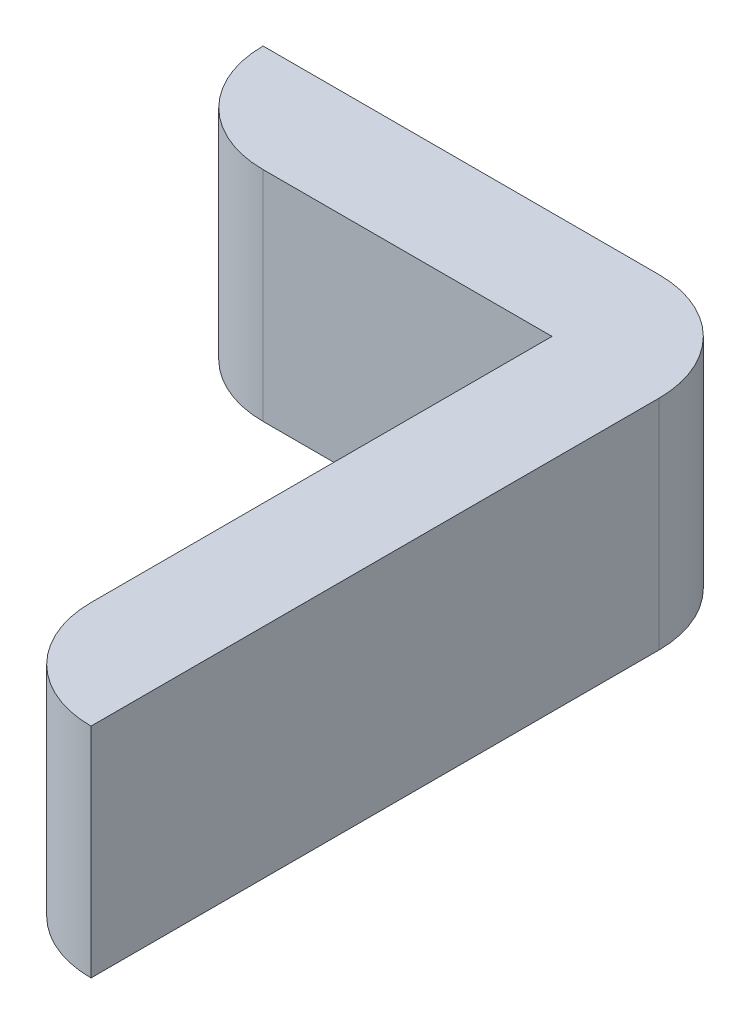
ISO-10303-21;
HEADER;
FILE_DESCRIPTION(('STEP AP214'),'2;1');
FILE_NAME('part.step','',(''),(''),'','','');
FILE_SCHEMA(('AUTOMOTIVE_DESIGN { 1 0 10303 214 1 1 1 1 }'));
ENDSEC;
DATA;
#1=APPLICATION_CONTEXT('core data for automotive mechanical design processes');
#2=APPLICATION_PROTOCOL_DEFINITION('international standard','automotive_design',2000,#1);
#3=PRODUCT_CONTEXT('',#1,'mechanical');
#4=PRODUCT('Part','Part','',(#3));
#5=PRODUCT_RELATED_PRODUCT_CATEGORY('part','',(#4));
#6=PRODUCT_DEFINITION_FORMATION('','',#4);
#7=PRODUCT_DEFINITION_CONTEXT('part definition',#1,'design');
#8=PRODUCT_DEFINITION('design','',#6,#7);
#9=PRODUCT_DEFINITION_SHAPE('','',#8);
#10=(LENGTH_UNIT() NAMED_UNIT(*) SI_UNIT(.MILLI.,.METRE.));
#11=(NAMED_UNIT(*) PLANE_ANGLE_UNIT() SI_UNIT($,.RADIAN.));
#12=(NAMED_UNIT(*) SI_UNIT($,.STERADIAN.) SOLID_ANGLE_UNIT());
#13=UNCERTAINTY_MEASURE_WITH_UNIT(LENGTH_MEASURE(1.E-05),#10,'distance_accuracy_value','');
#14=(GEOMETRIC_REPRESENTATION_CONTEXT(3) GLOBAL_UNCERTAINTY_ASSIGNED_CONTEXT((#13)) GLOBAL_UNIT_ASSIGNED_CONTEXT((#10,
#11,#12)) REPRESENTATION_CONTEXT('',''));
#15=CARTESIAN_POINT('',(0.,0.,0.));
#16=DIRECTION('',(0.,0.,1.));
#17=DIRECTION('',(1.,0.,0.));
#18=AXIS2_PLACEMENT_3D('',#15,#16,#17);
#19=CARTESIAN_POINT('',(9.275,2.7948,0.));
#20=DIRECTION('',(0.,-1.,0.));
#21=DIRECTION('',(0.,0.,-1.));
#22=AXIS2_PLACEMENT_3D('',#19,#20,#21);
#23=PLANE('',#22);
#24=DIRECTION('',(-1.,0.,0.));
#25=VECTOR('',#24,1.);
#26=CARTESIAN_POINT('',(9.525,2.7948,0.25));
#27=LINE('',#26,#25);
#28=CARTESIAN_POINT('',(9.525,2.7948,0.25));
#29=VERTEX_POINT('',#28);
#30=CARTESIAN_POINT('',(10.2,2.7948,0.25));
#31=VERTEX_POINT('',#30);
#32=EDGE_CURVE('E102',#29,#31,#27,.F.);
#33=ORIENTED_EDGE('',*,*,#32,.T.);
#34=DIRECTION('',(0.,0.,-1.));
#35=VECTOR('',#34,1.);
#36=CARTESIAN_POINT('',(10.2,2.7948,0.25));
#37=LINE('',#36,#35);
#38=CARTESIAN_POINT('',(10.2,2.7948,1.327));
#39=VERTEX_POINT('',#38);
#40=EDGE_CURVE('E108',#31,#39,#37,.F.);
#41=ORIENTED_EDGE('',*,*,#40,.T.);
#42=CARTESIAN_POINT('',(10.45,2.7948,1.327));
#43=DIRECTION('',(0.,-1.,0.));
#44=DIRECTION('',(0.,0.,-1.));
#45=AXIS2_PLACEMENT_3D('',#42,#43,#44);
#46=CIRCLE('',#45,0.25);
#47=CARTESIAN_POINT('',(10.45,2.7948,1.577));
#48=VERTEX_POINT('',#47);
#49=EDGE_CURVE('E80',#48,#39,#46,.T.);
#50=ORIENTED_EDGE('',*,*,#49,.F.);
#51=DIRECTION('',(0.,0.,1.));
#52=VECTOR('',#51,1.);
#53=CARTESIAN_POINT('',(10.45,2.7948,1.577));
#54=LINE('',#53,#52);
#55=CARTESIAN_POINT('',(10.45,2.7948,0.25));
#56=VERTEX_POINT('',#55);
#57=EDGE_CURVE('E75',#48,#56,#54,.F.);
#58=ORIENTED_EDGE('',*,*,#57,.T.);
#59=CARTESIAN_POINT('',(10.2,2.7948,0.25));
#60=DIRECTION('',(0.,-1.,0.));
#61=DIRECTION('',(0.,0.,-1.));
#62=AXIS2_PLACEMENT_3D('',#59,#60,#61);
#63=CIRCLE('',#62,0.25);
#64=CARTESIAN_POINT('',(10.2,2.7948,0.));
#65=VERTEX_POINT('',#64);
#66=EDGE_CURVE('E19',#65,#56,#63,.T.);
#67=ORIENTED_EDGE('',*,*,#66,.F.);
#68=DIRECTION('',(1.,0.,0.));
#69=VECTOR('',#68,1.);
#70=CARTESIAN_POINT('',(10.2,2.7948,0.));
#71=LINE('',#70,#69);
#72=CARTESIAN_POINT('',(9.275,2.7948,0.));
#73=VERTEX_POINT('',#72);
#74=EDGE_CURVE('E70',#65,#73,#71,.F.);
#75=ORIENTED_EDGE('',*,*,#74,.T.);
#76=CARTESIAN_POINT('',(9.525,2.7948,0.));
#77=DIRECTION('',(0.,-1.,0.));
#78=DIRECTION('',(0.,0.,-1.));
#79=AXIS2_PLACEMENT_3D('',#76,#77,#78);
#80=CIRCLE('',#79,0.25);
#81=EDGE_CURVE('E121',#29,#73,#80,.T.);
#82=ORIENTED_EDGE('',*,*,#81,.F.);
#83=EDGE_LOOP('',(#33,#41,#50,#58,#67,#75,#82));
#84=FACE_BOUND('',#83,.T.);
#85=ADVANCED_FACE('F16',(#84),#23,.F.);
#86=CARTESIAN_POINT('',(10.2,2.2852,0.));
#87=DIRECTION('',(0.,0.,1.));
#88=DIRECTION('',(1.,0.,0.));
#89=AXIS2_PLACEMENT_3D('',#86,#87,#88);
#90=PLANE('',#89);
#91=DIRECTION('',(0.,-1.,0.));
#92=VECTOR('',#91,1.);
#93=CARTESIAN_POINT('',(9.275,2.2852,0.));
#94=LINE('',#93,#92);
#95=CARTESIAN_POINT('',(9.275,2.2852,0.));
#96=VERTEX_POINT('',#95);
#97=EDGE_CURVE('E123',#73,#96,#94,.T.);
#98=ORIENTED_EDGE('',*,*,#97,.F.);
#99=ORIENTED_EDGE('',*,*,#74,.F.);
#100=DIRECTION('',(0.,-1.,0.));
#101=VECTOR('',#100,1.);
#102=CARTESIAN_POINT('',(10.2,2.2852,0.));
#103=LINE('',#102,#101);
#104=CARTESIAN_POINT('',(10.2,2.2852,0.));
#105=VERTEX_POINT('',#104);
#106=EDGE_CURVE('E92',#105,#65,#103,.F.);
#107=ORIENTED_EDGE('',*,*,#106,.F.);
#108=DIRECTION('',(1.,0.,0.));
#109=VECTOR('',#108,1.);
#110=CARTESIAN_POINT('',(9.275,2.2852,0.));
#111=LINE('',#110,#109);
#112=EDGE_CURVE('E120',#96,#105,#111,.T.);
#113=ORIENTED_EDGE('',*,*,#112,.F.);
#114=EDGE_LOOP('',(#98,#99,#107,#113));
#115=FACE_BOUND('',#114,.T.);
#116=ADVANCED_FACE('F158',(#115),#90,.F.);
#117=CARTESIAN_POINT('',(10.2,2.2852,0.25));
#118=DIRECTION('',(0.,-1.,0.));
#119=DIRECTION('',(0.,0.,-1.));
#120=AXIS2_PLACEMENT_3D('',#117,#118,#119);
#121=CYLINDRICAL_SURFACE('',#120,0.25);
#122=ORIENTED_EDGE('',*,*,#66,.T.);
#123=DIRECTION('',(0.,1.,0.));
#124=VECTOR('',#123,1.);
#125=CARTESIAN_POINT('',(10.45,2.2852,0.25));
#126=LINE('',#125,#124);
#127=CARTESIAN_POINT('',(10.45,2.2852,0.25));
#128=VERTEX_POINT('',#127);
#129=EDGE_CURVE('E86',#56,#128,#126,.F.);
#130=ORIENTED_EDGE('',*,*,#129,.T.);
#131=CARTESIAN_POINT('',(10.2,2.2852,0.25));
#132=DIRECTION('',(0.,-1.,0.));
#133=DIRECTION('',(0.,0.,-1.));
#134=AXIS2_PLACEMENT_3D('',#131,#132,#133);
#135=CIRCLE('',#134,0.25);
#136=EDGE_CURVE('E118',#105,#128,#135,.T.);
#137=ORIENTED_EDGE('',*,*,#136,.F.);
#138=ORIENTED_EDGE('',*,*,#106,.T.);
#139=EDGE_LOOP('',(#122,#130,#137,#138));
#140=FACE_BOUND('',#139,.T.);
#141=ADVANCED_FACE('F89',(#140),#121,.T.);
#142=CARTESIAN_POINT('',(10.45,2.2852,1.577));
#143=DIRECTION('',(-1.,0.,0.));
#144=DIRECTION('',(0.,0.,1.));
#145=AXIS2_PLACEMENT_3D('',#142,#143,#144);
#146=PLANE('',#145);
#147=DIRECTION('',(0.,-1.,0.));
#148=VECTOR('',#147,1.);
#149=CARTESIAN_POINT('',(10.45,2.2852,1.577));
#150=LINE('',#149,#148);
#151=CARTESIAN_POINT('',(10.45,2.2852,1.577));
#152=VERTEX_POINT('',#151);
#153=EDGE_CURVE('E85',#152,#48,#150,.F.);
#154=ORIENTED_EDGE('',*,*,#153,.F.);
#155=DIRECTION('',(0.,0.,-1.));
#156=VECTOR('',#155,1.);
#157=CARTESIAN_POINT('',(10.45,2.2852,0.));
#158=LINE('',#157,#156);
#159=EDGE_CURVE('E94',#128,#152,#158,.F.);
#160=ORIENTED_EDGE('',*,*,#159,.F.);
#161=ORIENTED_EDGE('',*,*,#129,.F.);
#162=ORIENTED_EDGE('',*,*,#57,.F.);
#163=EDGE_LOOP('',(#154,#160,#161,#162));
#164=FACE_BOUND('',#163,.T.);
#165=ADVANCED_FACE('F93',(#164),#146,.F.);
#166=CARTESIAN_POINT('',(10.45,2.2852,1.327));
#167=DIRECTION('',(0.,-1.,0.));
#168=DIRECTION('',(0.,0.,-1.));
#169=AXIS2_PLACEMENT_3D('',#166,#167,#168);
#170=CYLINDRICAL_SURFACE('',#169,0.25);
#171=ORIENTED_EDGE('',*,*,#49,.T.);
#172=DIRECTION('',(0.,1.,0.));
#173=VECTOR('',#172,1.);
#174=CARTESIAN_POINT('',(10.2,2.2852,1.327));
#175=LINE('',#174,#173);
#176=CARTESIAN_POINT('',(10.2,2.2852,1.327));
#177=VERTEX_POINT('',#176);
#178=EDGE_CURVE('E105',#39,#177,#175,.F.);
#179=ORIENTED_EDGE('',*,*,#178,.T.);
#180=CARTESIAN_POINT('',(10.45,2.2852,1.327));
#181=DIRECTION('',(0.,-1.,0.));
#182=DIRECTION('',(0.,0.,-1.));
#183=AXIS2_PLACEMENT_3D('',#180,#181,#182);
#184=CIRCLE('',#183,0.25);
#185=EDGE_CURVE('E114',#152,#177,#184,.T.);
#186=ORIENTED_EDGE('',*,*,#185,.F.);
#187=ORIENTED_EDGE('',*,*,#153,.T.);
#188=EDGE_LOOP('',(#171,#179,#186,#187));
#189=FACE_BOUND('',#188,.T.);
#190=ADVANCED_FACE('F127',(#189),#170,.T.);
#191=CARTESIAN_POINT('',(10.2,2.2852,0.25));
#192=DIRECTION('',(1.,0.,0.));
#193=DIRECTION('',(0.,0.,-1.));
#194=AXIS2_PLACEMENT_3D('',#191,#192,#193);
#195=PLANE('',#194);
#196=ORIENTED_EDGE('',*,*,#178,.F.);
#197=ORIENTED_EDGE('',*,*,#40,.F.);
#198=DIRECTION('',(0.,1.,0.));
#199=VECTOR('',#198,1.);
#200=CARTESIAN_POINT('',(10.2,2.2852,0.25));
#201=LINE('',#200,#199);
#202=CARTESIAN_POINT('',(10.2,2.2852,0.25));
#203=VERTEX_POINT('',#202);
#204=EDGE_CURVE('E104',#31,#203,#201,.F.);
#205=ORIENTED_EDGE('',*,*,#204,.T.);
#206=DIRECTION('',(0.,0.,-1.));
#207=VECTOR('',#206,1.);
#208=CARTESIAN_POINT('',(10.2,2.2852,0.));
#209=LINE('',#208,#207);
#210=EDGE_CURVE('E117',#177,#203,#209,.T.);
#211=ORIENTED_EDGE('',*,*,#210,.F.);
#212=EDGE_LOOP('',(#196,#197,#205,#211));
#213=FACE_BOUND('',#212,.T.);
#214=ADVANCED_FACE('F150',(#213),#195,.F.);
#215=CARTESIAN_POINT('',(9.525,2.2852,0.25));
#216=DIRECTION('',(0.,0.,-1.));
#217=DIRECTION('',(-1.,0.,0.));
#218=AXIS2_PLACEMENT_3D('',#215,#216,#217);
#219=PLANE('',#218);
#220=ORIENTED_EDGE('',*,*,#204,.F.);
#221=ORIENTED_EDGE('',*,*,#32,.F.);
#222=DIRECTION('',(0.,-1.,0.));
#223=VECTOR('',#222,1.);
#224=CARTESIAN_POINT('',(9.525,2.2852,0.25));
#225=LINE('',#224,#223);
#226=CARTESIAN_POINT('',(9.525,2.2852,0.25));
#227=VERTEX_POINT('',#226);
#228=EDGE_CURVE('E34',#227,#29,#225,.F.);
#229=ORIENTED_EDGE('',*,*,#228,.F.);
#230=DIRECTION('',(1.,0.,0.));
#231=VECTOR('',#230,1.);
#232=CARTESIAN_POINT('',(9.275,2.2852,0.25));
#233=LINE('',#232,#231);
#234=EDGE_CURVE('E25',#203,#227,#233,.F.);
#235=ORIENTED_EDGE('',*,*,#234,.F.);
#236=EDGE_LOOP('',(#220,#221,#229,#235));
#237=FACE_BOUND('',#236,.T.);
#238=ADVANCED_FACE('F151',(#237),#219,.F.);
#239=CARTESIAN_POINT('',(9.525,2.2852,0.));
#240=DIRECTION('',(0.,-1.,0.));
#241=DIRECTION('',(0.,0.,-1.));
#242=AXIS2_PLACEMENT_3D('',#239,#240,#241);
#243=CYLINDRICAL_SURFACE('',#242,0.25);
#244=ORIENTED_EDGE('',*,*,#81,.T.);
#245=ORIENTED_EDGE('',*,*,#97,.T.);
#246=CARTESIAN_POINT('',(9.525,2.2852,0.));
#247=DIRECTION('',(0.,-1.,0.));
#248=DIRECTION('',(0.,0.,-1.));
#249=AXIS2_PLACEMENT_3D('',#246,#247,#248);
#250=CIRCLE('',#249,0.25);
#251=EDGE_CURVE('E11',#227,#96,#250,.T.);
#252=ORIENTED_EDGE('',*,*,#251,.F.);
#253=ORIENTED_EDGE('',*,*,#228,.T.);
#254=EDGE_LOOP('',(#244,#245,#252,#253));
#255=FACE_BOUND('',#254,.T.);
#256=ADVANCED_FACE('F156',(#255),#243,.T.);
#257=CARTESIAN_POINT('',(9.275,2.2852,0.));
#258=DIRECTION('',(0.,-1.,0.));
#259=DIRECTION('',(0.,0.,-1.));
#260=AXIS2_PLACEMENT_3D('',#257,#258,#259);
#261=PLANE('',#260);
#262=ORIENTED_EDGE('',*,*,#234,.T.);
#263=ORIENTED_EDGE('',*,*,#251,.T.);
#264=ORIENTED_EDGE('',*,*,#112,.T.);
#265=ORIENTED_EDGE('',*,*,#136,.T.);
#266=ORIENTED_EDGE('',*,*,#159,.T.);
#267=ORIENTED_EDGE('',*,*,#185,.T.);
#268=ORIENTED_EDGE('',*,*,#210,.T.);
#269=EDGE_LOOP('',(#262,#263,#264,#265,#266,#267,#268));
#270=FACE_BOUND('',#269,.T.);
#271=ADVANCED_FACE('F132',(#270),#261,.T.);
#272=CLOSED_SHELL('',(#85,#116,#141,#165,#190,#214,#238,#256,#271));
#273=MANIFOLD_SOLID_BREP('B1',#272);
#274=ADVANCED_BREP_SHAPE_REPRESENTATION('',(#18,#273),#14);
#275=SHAPE_DEFINITION_REPRESENTATION(#9,#274);
ENDSEC;
END-ISO-10303-21;
